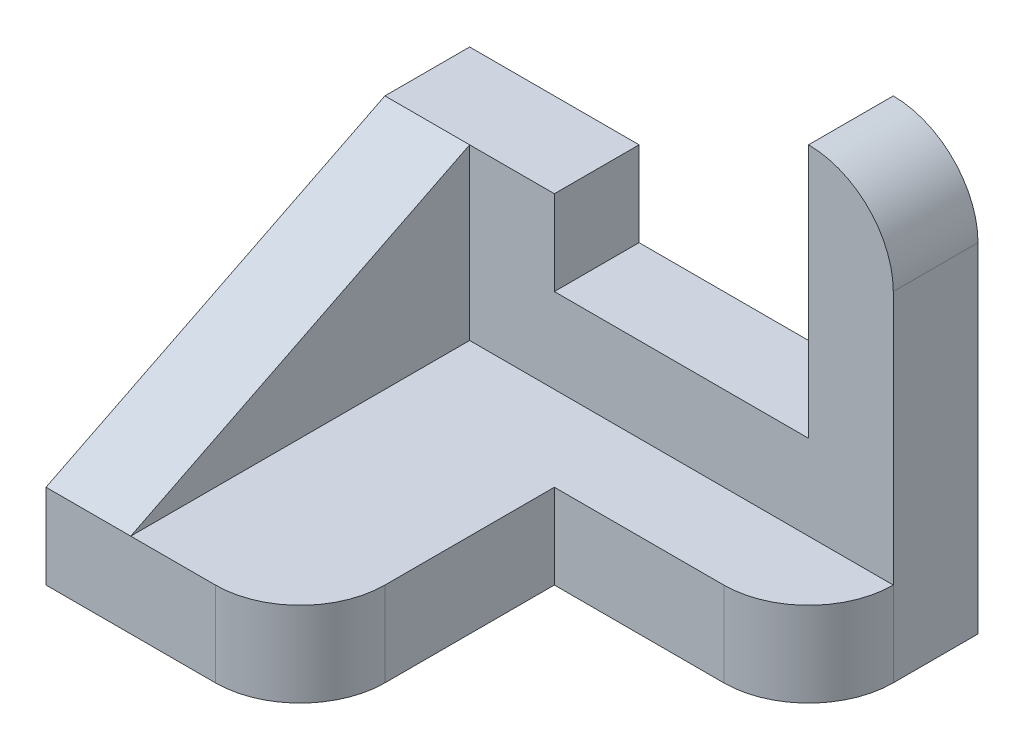
ISO-10303-21;
HEADER;
FILE_DESCRIPTION(('STEP AP214'),'2;1');
FILE_NAME('part.step','',(''),(''),'','','');
FILE_SCHEMA(('AUTOMOTIVE_DESIGN { 1 0 10303 214 1 1 1 1 }'));
ENDSEC;
DATA;
#1=APPLICATION_CONTEXT('core data for automotive mechanical design processes');
#2=APPLICATION_PROTOCOL_DEFINITION('international standard','automotive_design',2000,#1);
#3=PRODUCT_CONTEXT('',#1,'mechanical');
#4=PRODUCT('Part','Part','',(#3));
#5=PRODUCT_RELATED_PRODUCT_CATEGORY('part','',(#4));
#6=PRODUCT_DEFINITION_FORMATION('','',#4);
#7=PRODUCT_DEFINITION_CONTEXT('part definition',#1,'design');
#8=PRODUCT_DEFINITION('design','',#6,#7);
#9=PRODUCT_DEFINITION_SHAPE('','',#8);
#10=(LENGTH_UNIT() NAMED_UNIT(*) SI_UNIT(.MILLI.,.METRE.));
#11=(NAMED_UNIT(*) PLANE_ANGLE_UNIT() SI_UNIT($,.RADIAN.));
#12=(NAMED_UNIT(*) SI_UNIT($,.STERADIAN.) SOLID_ANGLE_UNIT());
#13=UNCERTAINTY_MEASURE_WITH_UNIT(LENGTH_MEASURE(1.E-05),#10,'distance_accuracy_value','');
#14=(GEOMETRIC_REPRESENTATION_CONTEXT(3) GLOBAL_UNCERTAINTY_ASSIGNED_CONTEXT((#13)) GLOBAL_UNIT_ASSIGNED_CONTEXT((#10,
#11,#12)) REPRESENTATION_CONTEXT('',''));
#15=CARTESIAN_POINT('',(0.,0.,0.));
#16=DIRECTION('',(0.,0.,1.));
#17=DIRECTION('',(1.,0.,0.));
#18=AXIS2_PLACEMENT_3D('',#15,#16,#17);
#19=CARTESIAN_POINT('',(0.,1.,0.));
#20=DIRECTION('',(0.,1.,0.));
#21=DIRECTION('',(0.,0.,1.));
#22=AXIS2_PLACEMENT_3D('',#19,#20,#21);
#23=PLANE('',#22);
#24=DIRECTION('',(0.,0.,-1.));
#25=VECTOR('',#24,1.);
#26=CARTESIAN_POINT('',(1.,1.,-4.));
#27=LINE('',#26,#25);
#28=CARTESIAN_POINT('',(1.,1.,0.));
#29=VERTEX_POINT('',#28);
#30=CARTESIAN_POINT('',(1.,1.,-4.));
#31=VERTEX_POINT('',#30);
#32=EDGE_CURVE('E139',#29,#31,#27,.T.);
#33=ORIENTED_EDGE('',*,*,#32,.F.);
#34=DIRECTION('',(-1.,0.,0.));
#35=VECTOR('',#34,1.);
#36=CARTESIAN_POINT('',(0.,1.,0.));
#37=LINE('',#36,#35);
#38=CARTESIAN_POINT('',(2.,1.,0.));
#39=VERTEX_POINT('',#38);
#40=EDGE_CURVE('E175',#39,#29,#37,.T.);
#41=ORIENTED_EDGE('',*,*,#40,.F.);
#42=CARTESIAN_POINT('',(2.,1.,-1.));
#43=DIRECTION('',(0.,1.,0.));
#44=DIRECTION('',(0.,0.,1.));
#45=AXIS2_PLACEMENT_3D('',#42,#43,#44);
#46=CIRCLE('',#45,1.);
#47=CARTESIAN_POINT('',(3.,1.,-1.));
#48=VERTEX_POINT('',#47);
#49=EDGE_CURVE('E177',#48,#39,#46,.F.);
#50=ORIENTED_EDGE('',*,*,#49,.F.);
#51=DIRECTION('',(0.,0.,1.));
#52=VECTOR('',#51,1.);
#53=CARTESIAN_POINT('',(3.,1.,0.));
#54=LINE('',#53,#52);
#55=CARTESIAN_POINT('',(3.,1.,-3.));
#56=VERTEX_POINT('',#55);
#57=EDGE_CURVE('E181',#56,#48,#54,.T.);
#58=ORIENTED_EDGE('',*,*,#57,.F.);
#59=DIRECTION('',(-1.,0.,0.));
#60=VECTOR('',#59,1.);
#61=CARTESIAN_POINT('',(0.,1.,-3.));
#62=LINE('',#61,#60);
#63=CARTESIAN_POINT('',(5.,1.,-3.));
#64=VERTEX_POINT('',#63);
#65=EDGE_CURVE('E184',#64,#56,#62,.T.);
#66=ORIENTED_EDGE('',*,*,#65,.F.);
#67=CARTESIAN_POINT('',(5.,1.,-4.));
#68=DIRECTION('',(0.,1.,0.));
#69=DIRECTION('',(0.,0.,1.));
#70=AXIS2_PLACEMENT_3D('',#67,#68,#69);
#71=CIRCLE('',#70,1.);
#72=CARTESIAN_POINT('',(6.,1.,-4.));
#73=VERTEX_POINT('',#72);
#74=EDGE_CURVE('E163',#73,#64,#71,.F.);
#75=ORIENTED_EDGE('',*,*,#74,.F.);
#76=DIRECTION('',(-1.,0.,0.));
#77=VECTOR('',#76,1.);
#78=CARTESIAN_POINT('',(0.,1.,-4.));
#79=LINE('',#78,#77);
#80=EDGE_CURVE('E154',#73,#31,#79,.T.);
#81=ORIENTED_EDGE('',*,*,#80,.T.);
#82=EDGE_LOOP('',(#33,#41,#50,#58,#66,#75,#81));
#83=FACE_BOUND('',#82,.T.);
#84=ADVANCED_FACE('F37',(#83),#23,.T.);
#85=CARTESIAN_POINT('',(6.00000000000001,1.,0.));
#86=DIRECTION('',(1.,0.,0.));
#87=DIRECTION('',(0.,0.,-1.));
#88=AXIS2_PLACEMENT_3D('',#85,#86,#87);
#89=PLANE('',#88);
#90=DIRECTION('',(0.,-1.,0.));
#91=VECTOR('',#90,1.);
#92=CARTESIAN_POINT('',(6.,1.,-5.));
#93=LINE('',#92,#91);
#94=CARTESIAN_POINT('',(6.,4.,-5.));
#95=VERTEX_POINT('',#94);
#96=CARTESIAN_POINT('',(6.,0.,-5.));
#97=VERTEX_POINT('',#96);
#98=EDGE_CURVE('E221',#95,#97,#93,.T.);
#99=ORIENTED_EDGE('',*,*,#98,.F.);
#100=DIRECTION('',(0.,0.,1.));
#101=VECTOR('',#100,1.);
#102=CARTESIAN_POINT('',(6.00000000000001,4.,0.));
#103=LINE('',#102,#101);
#104=CARTESIAN_POINT('',(6.,4.,-4.));
#105=VERTEX_POINT('',#104);
#106=EDGE_CURVE('E223',#95,#105,#103,.T.);
#107=ORIENTED_EDGE('',*,*,#106,.T.);
#108=DIRECTION('',(0.,-1.,0.));
#109=VECTOR('',#108,1.);
#110=CARTESIAN_POINT('',(6.,5.,-4.));
#111=LINE('',#110,#109);
#112=EDGE_CURVE('E229',#105,#73,#111,.T.);
#113=ORIENTED_EDGE('',*,*,#112,.T.);
#114=DIRECTION('',(0.,-1.,0.));
#115=VECTOR('',#114,1.);
#116=CARTESIAN_POINT('',(6.,1.,-4.));
#117=LINE('',#116,#115);
#118=CARTESIAN_POINT('',(6.,0.,-4.));
#119=VERTEX_POINT('',#118);
#120=EDGE_CURVE('E187',#73,#119,#117,.T.);
#121=ORIENTED_EDGE('',*,*,#120,.T.);
#122=DIRECTION('',(0.,0.,1.));
#123=VECTOR('',#122,1.);
#124=CARTESIAN_POINT('',(6.00000000000001,0.,0.));
#125=LINE('',#124,#123);
#126=EDGE_CURVE('E164',#97,#119,#125,.T.);
#127=ORIENTED_EDGE('',*,*,#126,.F.);
#128=EDGE_LOOP('',(#99,#107,#113,#121,#127));
#129=FACE_BOUND('',#128,.T.);
#130=ADVANCED_FACE('F305',(#129),#89,.T.);
#131=CARTESIAN_POINT('',(0.,1.,-5.));
#132=DIRECTION('',(0.,0.,-1.));
#133=DIRECTION('',(-1.,0.,0.));
#134=AXIS2_PLACEMENT_3D('',#131,#132,#133);
#135=PLANE('',#134);
#136=DIRECTION('',(0.,-1.,0.));
#137=VECTOR('',#136,1.);
#138=CARTESIAN_POINT('',(5.,5.,-5.));
#139=LINE('',#138,#137);
#140=CARTESIAN_POINT('',(5.,5.,-5.));
#141=VERTEX_POINT('',#140);
#142=CARTESIAN_POINT('',(5.,2.,-5.));
#143=VERTEX_POINT('',#142);
#144=EDGE_CURVE('E239',#141,#143,#139,.T.);
#145=ORIENTED_EDGE('',*,*,#144,.F.);
#146=CARTESIAN_POINT('',(5.,4.,-5.));
#147=DIRECTION('',(0.,0.,-1.));
#148=DIRECTION('',(-1.,0.,0.));
#149=AXIS2_PLACEMENT_3D('',#146,#147,#148);
#150=CIRCLE('',#149,1.);
#151=EDGE_CURVE('E11',#141,#95,#150,.T.);
#152=ORIENTED_EDGE('',*,*,#151,.T.);
#153=ORIENTED_EDGE('',*,*,#98,.T.);
#154=DIRECTION('',(1.,0.,0.));
#155=VECTOR('',#154,1.);
#156=CARTESIAN_POINT('',(0.,0.,-5.));
#157=LINE('',#156,#155);
#158=CARTESIAN_POINT('',(0.,0.,-5.));
#159=VERTEX_POINT('',#158);
#160=EDGE_CURVE('E168',#159,#97,#157,.T.);
#161=ORIENTED_EDGE('',*,*,#160,.F.);
#162=DIRECTION('',(0.,-1.,0.));
#163=VECTOR('',#162,1.);
#164=CARTESIAN_POINT('',(0.,1.,-5.));
#165=LINE('',#164,#163);
#166=CARTESIAN_POINT('',(0.,3.,-5.));
#167=VERTEX_POINT('',#166);
#168=EDGE_CURVE('E218',#167,#159,#165,.T.);
#169=ORIENTED_EDGE('',*,*,#168,.F.);
#170=DIRECTION('',(1.,0.,0.));
#171=VECTOR('',#170,1.);
#172=CARTESIAN_POINT('',(0.,3.,-5.));
#173=LINE('',#172,#171);
#174=CARTESIAN_POINT('',(2.,3.,-5.));
#175=VERTEX_POINT('',#174);
#176=EDGE_CURVE('E250',#167,#175,#173,.T.);
#177=ORIENTED_EDGE('',*,*,#176,.T.);
#178=DIRECTION('',(0.,-1.,0.));
#179=VECTOR('',#178,1.);
#180=CARTESIAN_POINT('',(2.,3.,-5.));
#181=LINE('',#180,#179);
#182=CARTESIAN_POINT('',(2.,2.,-5.));
#183=VERTEX_POINT('',#182);
#184=EDGE_CURVE('E260',#175,#183,#181,.T.);
#185=ORIENTED_EDGE('',*,*,#184,.T.);
#186=DIRECTION('',(1.,0.,0.));
#187=VECTOR('',#186,1.);
#188=CARTESIAN_POINT('',(0.,2.,-5.));
#189=LINE('',#188,#187);
#190=EDGE_CURVE('E171',#183,#143,#189,.T.);
#191=ORIENTED_EDGE('',*,*,#190,.T.);
#192=EDGE_LOOP('',(#145,#152,#153,#161,#169,#177,#185,#191));
#193=FACE_BOUND('',#192,.T.);
#194=ADVANCED_FACE('F268',(#193),#135,.T.);
#195=CARTESIAN_POINT('',(0.,1.,0.));
#196=DIRECTION('',(-1.,0.,0.));
#197=DIRECTION('',(0.,0.,1.));
#198=AXIS2_PLACEMENT_3D('',#195,#196,#197);
#199=PLANE('',#198);
#200=ORIENTED_EDGE('',*,*,#168,.T.);
#201=DIRECTION('',(0.,0.,-1.));
#202=VECTOR('',#201,1.);
#203=CARTESIAN_POINT('',(0.,0.,0.));
#204=LINE('',#203,#202);
#205=CARTESIAN_POINT('',(0.,0.,0.));
#206=VERTEX_POINT('',#205);
#207=EDGE_CURVE('E191',#206,#159,#204,.T.);
#208=ORIENTED_EDGE('',*,*,#207,.F.);
#209=DIRECTION('',(0.,-1.,0.));
#210=VECTOR('',#209,1.);
#211=CARTESIAN_POINT('',(0.,1.,0.));
#212=LINE('',#211,#210);
#213=CARTESIAN_POINT('',(0.,1.,0.));
#214=VERTEX_POINT('',#213);
#215=EDGE_CURVE('E216',#214,#206,#212,.T.);
#216=ORIENTED_EDGE('',*,*,#215,.F.);
#217=DIRECTION('',(0.,-0.447213595499957,0.894427190999916));
#218=VECTOR('',#217,1.);
#219=CARTESIAN_POINT('',(0.,1.,0.));
#220=LINE('',#219,#218);
#221=CARTESIAN_POINT('',(0.,3.,-4.));
#222=VERTEX_POINT('',#221);
#223=EDGE_CURVE('E148',#222,#214,#220,.T.);
#224=ORIENTED_EDGE('',*,*,#223,.F.);
#225=DIRECTION('',(0.,0.,-1.));
#226=VECTOR('',#225,1.);
#227=CARTESIAN_POINT('',(0.,3.,0.));
#228=LINE('',#227,#226);
#229=EDGE_CURVE('E253',#222,#167,#228,.T.);
#230=ORIENTED_EDGE('',*,*,#229,.T.);
#231=EDGE_LOOP('',(#200,#208,#216,#224,#230));
#232=FACE_BOUND('',#231,.T.);
#233=ADVANCED_FACE('F281',(#232),#199,.T.);
#234=CARTESIAN_POINT('',(0.,1.,0.));
#235=DIRECTION('',(0.,0.,1.));
#236=DIRECTION('',(1.,0.,0.));
#237=AXIS2_PLACEMENT_3D('',#234,#235,#236);
#238=PLANE('',#237);
#239=DIRECTION('',(-1.,0.,0.));
#240=VECTOR('',#239,1.);
#241=CARTESIAN_POINT('',(0.,0.,0.));
#242=LINE('',#241,#240);
#243=CARTESIAN_POINT('',(2.,0.,0.));
#244=VERTEX_POINT('',#243);
#245=EDGE_CURVE('E193',#244,#206,#242,.T.);
#246=ORIENTED_EDGE('',*,*,#245,.F.);
#247=DIRECTION('',(0.,-1.,0.));
#248=VECTOR('',#247,1.);
#249=CARTESIAN_POINT('',(2.,1.,0.));
#250=LINE('',#249,#248);
#251=EDGE_CURVE('E214',#39,#244,#250,.T.);
#252=ORIENTED_EDGE('',*,*,#251,.F.);
#253=ORIENTED_EDGE('',*,*,#40,.T.);
#254=DIRECTION('',(-1.,0.,0.));
#255=VECTOR('',#254,1.);
#256=CARTESIAN_POINT('',(1.,1.,0.));
#257=LINE('',#256,#255);
#258=EDGE_CURVE('E240',#29,#214,#257,.T.);
#259=ORIENTED_EDGE('',*,*,#258,.T.);
#260=ORIENTED_EDGE('',*,*,#215,.T.);
#261=EDGE_LOOP('',(#246,#252,#253,#259,#260));
#262=FACE_BOUND('',#261,.T.);
#263=ADVANCED_FACE('F287',(#262),#238,.T.);
#264=CARTESIAN_POINT('',(2.,1.,-1.));
#265=DIRECTION('',(0.,-1.,0.));
#266=DIRECTION('',(0.,0.,-1.));
#267=AXIS2_PLACEMENT_3D('',#264,#265,#266);
#268=CYLINDRICAL_SURFACE('',#267,1.);
#269=CARTESIAN_POINT('',(2.,0.,-1.));
#270=DIRECTION('',(0.,1.,0.));
#271=DIRECTION('',(0.,0.,1.));
#272=AXIS2_PLACEMENT_3D('',#269,#270,#271);
#273=CIRCLE('',#272,1.);
#274=CARTESIAN_POINT('',(3.,0.,-1.));
#275=VERTEX_POINT('',#274);
#276=EDGE_CURVE('E196',#275,#244,#273,.F.);
#277=ORIENTED_EDGE('',*,*,#276,.F.);
#278=DIRECTION('',(0.,-1.,0.));
#279=VECTOR('',#278,1.);
#280=CARTESIAN_POINT('',(3.,1.,-1.));
#281=LINE('',#280,#279);
#282=EDGE_CURVE('E212',#48,#275,#281,.T.);
#283=ORIENTED_EDGE('',*,*,#282,.F.);
#284=ORIENTED_EDGE('',*,*,#49,.T.);
#285=ORIENTED_EDGE('',*,*,#251,.T.);
#286=EDGE_LOOP('',(#277,#283,#284,#285));
#287=FACE_BOUND('',#286,.T.);
#288=ADVANCED_FACE('F292',(#287),#268,.T.);
#289=CARTESIAN_POINT('',(3.,1.,0.));
#290=DIRECTION('',(1.,0.,0.));
#291=DIRECTION('',(0.,0.,-1.));
#292=AXIS2_PLACEMENT_3D('',#289,#290,#291);
#293=PLANE('',#292);
#294=DIRECTION('',(0.,0.,1.));
#295=VECTOR('',#294,1.);
#296=CARTESIAN_POINT('',(3.,0.,0.));
#297=LINE('',#296,#295);
#298=CARTESIAN_POINT('',(3.,0.,-3.));
#299=VERTEX_POINT('',#298);
#300=EDGE_CURVE('E199',#299,#275,#297,.T.);
#301=ORIENTED_EDGE('',*,*,#300,.F.);
#302=DIRECTION('',(0.,-1.,0.));
#303=VECTOR('',#302,1.);
#304=CARTESIAN_POINT('',(3.,1.,-3.));
#305=LINE('',#304,#303);
#306=EDGE_CURVE('E210',#56,#299,#305,.T.);
#307=ORIENTED_EDGE('',*,*,#306,.F.);
#308=ORIENTED_EDGE('',*,*,#57,.T.);
#309=ORIENTED_EDGE('',*,*,#282,.T.);
#310=EDGE_LOOP('',(#301,#307,#308,#309));
#311=FACE_BOUND('',#310,.T.);
#312=ADVANCED_FACE('F295',(#311),#293,.T.);
#313=CARTESIAN_POINT('',(0.,1.,-3.));
#314=DIRECTION('',(0.,0.,1.));
#315=DIRECTION('',(1.,0.,0.));
#316=AXIS2_PLACEMENT_3D('',#313,#314,#315);
#317=PLANE('',#316);
#318=DIRECTION('',(-1.,0.,0.));
#319=VECTOR('',#318,1.);
#320=CARTESIAN_POINT('',(0.,0.,-3.));
#321=LINE('',#320,#319);
#322=CARTESIAN_POINT('',(5.,0.,-3.));
#323=VERTEX_POINT('',#322);
#324=EDGE_CURVE('E202',#323,#299,#321,.T.);
#325=ORIENTED_EDGE('',*,*,#324,.F.);
#326=DIRECTION('',(0.,-1.,0.));
#327=VECTOR('',#326,1.);
#328=CARTESIAN_POINT('',(5.,1.,-3.));
#329=LINE('',#328,#327);
#330=EDGE_CURVE('E208',#64,#323,#329,.T.);
#331=ORIENTED_EDGE('',*,*,#330,.F.);
#332=ORIENTED_EDGE('',*,*,#65,.T.);
#333=ORIENTED_EDGE('',*,*,#306,.T.);
#334=EDGE_LOOP('',(#325,#331,#332,#333));
#335=FACE_BOUND('',#334,.T.);
#336=ADVANCED_FACE('F298',(#335),#317,.T.);
#337=CARTESIAN_POINT('',(5.,1.,-4.));
#338=DIRECTION('',(0.,-1.,0.));
#339=DIRECTION('',(0.,0.,-1.));
#340=AXIS2_PLACEMENT_3D('',#337,#338,#339);
#341=CYLINDRICAL_SURFACE('',#340,1.);
#342=CARTESIAN_POINT('',(5.,0.,-4.));
#343=DIRECTION('',(0.,1.,0.));
#344=DIRECTION('',(0.,0.,1.));
#345=AXIS2_PLACEMENT_3D('',#342,#343,#344);
#346=CIRCLE('',#345,1.);
#347=EDGE_CURVE('E178',#119,#323,#346,.F.);
#348=ORIENTED_EDGE('',*,*,#347,.F.);
#349=ORIENTED_EDGE('',*,*,#120,.F.);
#350=ORIENTED_EDGE('',*,*,#74,.T.);
#351=ORIENTED_EDGE('',*,*,#330,.T.);
#352=EDGE_LOOP('',(#348,#349,#350,#351));
#353=FACE_BOUND('',#352,.T.);
#354=ADVANCED_FACE('F301',(#353),#341,.T.);
#355=CARTESIAN_POINT('',(0.,0.,0.));
#356=DIRECTION('',(0.,1.,0.));
#357=DIRECTION('',(0.,0.,1.));
#358=AXIS2_PLACEMENT_3D('',#355,#356,#357);
#359=PLANE('',#358);
#360=ORIENTED_EDGE('',*,*,#160,.T.);
#361=ORIENTED_EDGE('',*,*,#126,.T.);
#362=ORIENTED_EDGE('',*,*,#347,.T.);
#363=ORIENTED_EDGE('',*,*,#324,.T.);
#364=ORIENTED_EDGE('',*,*,#300,.T.);
#365=ORIENTED_EDGE('',*,*,#276,.T.);
#366=ORIENTED_EDGE('',*,*,#245,.T.);
#367=ORIENTED_EDGE('',*,*,#207,.T.);
#368=EDGE_LOOP('',(#360,#361,#362,#363,#364,#365,#366,#367));
#369=FACE_BOUND('',#368,.T.);
#370=ADVANCED_FACE('F307',(#369),#359,.F.);
#371=CARTESIAN_POINT('',(0.,2.,-4.));
#372=DIRECTION('',(0.,0.,-1.));
#373=DIRECTION('',(-1.,0.,0.));
#374=AXIS2_PLACEMENT_3D('',#371,#372,#373);
#375=PLANE('',#374);
#376=DIRECTION('',(1.,0.,0.));
#377=VECTOR('',#376,1.);
#378=CARTESIAN_POINT('',(0.,3.,-4.));
#379=LINE('',#378,#377);
#380=CARTESIAN_POINT('',(1.,3.,-4.));
#381=VERTEX_POINT('',#380);
#382=CARTESIAN_POINT('',(2.,3.,-4.));
#383=VERTEX_POINT('',#382);
#384=EDGE_CURVE('E157',#381,#383,#379,.T.);
#385=ORIENTED_EDGE('',*,*,#384,.F.);
#386=DIRECTION('',(0.,1.,0.));
#387=VECTOR('',#386,1.);
#388=CARTESIAN_POINT('',(1.,3.,-4.));
#389=LINE('',#388,#387);
#390=EDGE_CURVE('E142',#31,#381,#389,.T.);
#391=ORIENTED_EDGE('',*,*,#390,.F.);
#392=ORIENTED_EDGE('',*,*,#80,.F.);
#393=ORIENTED_EDGE('',*,*,#112,.F.);
#394=CARTESIAN_POINT('',(5.,4.,-4.));
#395=DIRECTION('',(0.,0.,-1.));
#396=DIRECTION('',(-1.,0.,0.));
#397=AXIS2_PLACEMENT_3D('',#394,#395,#396);
#398=CIRCLE('',#397,1.);
#399=CARTESIAN_POINT('',(5.,5.,-4.));
#400=VERTEX_POINT('',#399);
#401=EDGE_CURVE('E45',#105,#400,#398,.F.);
#402=ORIENTED_EDGE('',*,*,#401,.T.);
#403=DIRECTION('',(0.,-1.,0.));
#404=VECTOR('',#403,1.);
#405=CARTESIAN_POINT('',(5.,5.,-4.));
#406=LINE('',#405,#404);
#407=CARTESIAN_POINT('',(5.,2.,-4.));
#408=VERTEX_POINT('',#407);
#409=EDGE_CURVE('E227',#400,#408,#406,.T.);
#410=ORIENTED_EDGE('',*,*,#409,.T.);
#411=DIRECTION('',(1.,0.,0.));
#412=VECTOR('',#411,1.);
#413=CARTESIAN_POINT('',(0.,2.,-4.));
#414=LINE('',#413,#412);
#415=CARTESIAN_POINT('',(2.,2.,-4.));
#416=VERTEX_POINT('',#415);
#417=EDGE_CURVE('E263',#416,#408,#414,.T.);
#418=ORIENTED_EDGE('',*,*,#417,.F.);
#419=DIRECTION('',(0.,-1.,0.));
#420=VECTOR('',#419,1.);
#421=CARTESIAN_POINT('',(2.,3.,-4.));
#422=LINE('',#421,#420);
#423=EDGE_CURVE('E258',#383,#416,#422,.T.);
#424=ORIENTED_EDGE('',*,*,#423,.F.);
#425=EDGE_LOOP('',(#385,#391,#392,#393,#402,#410,#418,#424));
#426=FACE_BOUND('',#425,.T.);
#427=ADVANCED_FACE('F152',(#426),#375,.F.);
#428=CARTESIAN_POINT('',(0.,2.,0.));
#429=DIRECTION('',(0.,1.,0.));
#430=DIRECTION('',(0.,0.,1.));
#431=AXIS2_PLACEMENT_3D('',#428,#429,#430);
#432=PLANE('',#431);
#433=ORIENTED_EDGE('',*,*,#417,.T.);
#434=DIRECTION('',(0.,0.,-1.));
#435=VECTOR('',#434,1.);
#436=CARTESIAN_POINT('',(5.,2.,0.));
#437=LINE('',#436,#435);
#438=EDGE_CURVE('E236',#408,#143,#437,.T.);
#439=ORIENTED_EDGE('',*,*,#438,.T.);
#440=ORIENTED_EDGE('',*,*,#190,.F.);
#441=DIRECTION('',(0.,0.,1.));
#442=VECTOR('',#441,1.);
#443=CARTESIAN_POINT('',(2.,2.,0.));
#444=LINE('',#443,#442);
#445=EDGE_CURVE('E165',#183,#416,#444,.T.);
#446=ORIENTED_EDGE('',*,*,#445,.T.);
#447=EDGE_LOOP('',(#433,#439,#440,#446));
#448=FACE_BOUND('',#447,.T.);
#449=ADVANCED_FACE('F270',(#448),#432,.T.);
#450=CARTESIAN_POINT('',(2.,3.,0.));
#451=DIRECTION('',(1.,0.,0.));
#452=DIRECTION('',(0.,0.,-1.));
#453=AXIS2_PLACEMENT_3D('',#450,#451,#452);
#454=PLANE('',#453);
#455=ORIENTED_EDGE('',*,*,#423,.T.);
#456=ORIENTED_EDGE('',*,*,#445,.F.);
#457=ORIENTED_EDGE('',*,*,#184,.F.);
#458=DIRECTION('',(0.,0.,1.));
#459=VECTOR('',#458,1.);
#460=CARTESIAN_POINT('',(2.,3.,0.));
#461=LINE('',#460,#459);
#462=EDGE_CURVE('E237',#175,#383,#461,.T.);
#463=ORIENTED_EDGE('',*,*,#462,.T.);
#464=EDGE_LOOP('',(#455,#456,#457,#463));
#465=FACE_BOUND('',#464,.T.);
#466=ADVANCED_FACE('F273',(#465),#454,.T.);
#467=CARTESIAN_POINT('',(0.,3.,0.));
#468=DIRECTION('',(0.,1.,0.));
#469=DIRECTION('',(0.,0.,1.));
#470=AXIS2_PLACEMENT_3D('',#467,#468,#469);
#471=PLANE('',#470);
#472=ORIENTED_EDGE('',*,*,#462,.F.);
#473=ORIENTED_EDGE('',*,*,#176,.F.);
#474=ORIENTED_EDGE('',*,*,#229,.F.);
#475=EDGE_CURVE('E256',#222,#381,#379,.T.);
#476=ORIENTED_EDGE('',*,*,#475,.T.);
#477=ORIENTED_EDGE('',*,*,#384,.T.);
#478=EDGE_LOOP('',(#472,#473,#474,#476,#477));
#479=FACE_BOUND('',#478,.T.);
#480=ADVANCED_FACE('F276',(#479),#471,.T.);
#481=CARTESIAN_POINT('',(5.,5.,0.));
#482=DIRECTION('',(-1.,0.,0.));
#483=DIRECTION('',(0.,0.,1.));
#484=AXIS2_PLACEMENT_3D('',#481,#482,#483);
#485=PLANE('',#484);
#486=ORIENTED_EDGE('',*,*,#144,.T.);
#487=ORIENTED_EDGE('',*,*,#438,.F.);
#488=ORIENTED_EDGE('',*,*,#409,.F.);
#489=DIRECTION('',(0.,0.,-1.));
#490=VECTOR('',#489,1.);
#491=CARTESIAN_POINT('',(5.,5.,0.));
#492=LINE('',#491,#490);
#493=EDGE_CURVE('E233',#400,#141,#492,.T.);
#494=ORIENTED_EDGE('',*,*,#493,.T.);
#495=EDGE_LOOP('',(#486,#487,#488,#494));
#496=FACE_BOUND('',#495,.T.);
#497=ADVANCED_FACE('F232',(#496),#485,.T.);
#498=CARTESIAN_POINT('',(5.00000000000001,4.,0.));
#499=DIRECTION('',(0.,0.,1.));
#500=DIRECTION('',(1.,0.,0.));
#501=AXIS2_PLACEMENT_3D('',#498,#499,#500);
#502=CYLINDRICAL_SURFACE('',#501,1.);
#503=ORIENTED_EDGE('',*,*,#151,.F.);
#504=ORIENTED_EDGE('',*,*,#493,.F.);
#505=ORIENTED_EDGE('',*,*,#401,.F.);
#506=ORIENTED_EDGE('',*,*,#106,.F.);
#507=EDGE_LOOP('',(#503,#504,#505,#506));
#508=FACE_BOUND('',#507,.T.);
#509=ADVANCED_FACE('F39',(#508),#502,.T.);
#510=CARTESIAN_POINT('',(1.,1.,0.));
#511=DIRECTION('',(0.,-0.894427190999916,-0.447213595499957));
#512=DIRECTION('',(0.,0.447213595499957,-0.894427190999916));
#513=AXIS2_PLACEMENT_3D('',#510,#511,#512);
#514=PLANE('',#513);
#515=ORIENTED_EDGE('',*,*,#223,.T.);
#516=ORIENTED_EDGE('',*,*,#258,.F.);
#517=DIRECTION('',(0.,-0.447213595499957,0.894427190999916));
#518=VECTOR('',#517,1.);
#519=CARTESIAN_POINT('',(1.,1.,0.));
#520=LINE('',#519,#518);
#521=EDGE_CURVE('E52',#381,#29,#520,.T.);
#522=ORIENTED_EDGE('',*,*,#521,.F.);
#523=ORIENTED_EDGE('',*,*,#475,.F.);
#524=EDGE_LOOP('',(#515,#516,#522,#523));
#525=FACE_BOUND('',#524,.T.);
#526=ADVANCED_FACE('F284',(#525),#514,.F.);
#527=CARTESIAN_POINT('',(1.,0.,0.));
#528=DIRECTION('',(1.,0.,0.));
#529=DIRECTION('',(0.,0.,-1.));
#530=AXIS2_PLACEMENT_3D('',#527,#528,#529);
#531=PLANE('',#530);
#532=ORIENTED_EDGE('',*,*,#32,.T.);
#533=ORIENTED_EDGE('',*,*,#390,.T.);
#534=ORIENTED_EDGE('',*,*,#521,.T.);
#535=EDGE_LOOP('',(#532,#533,#534));
#536=FACE_BOUND('',#535,.T.);
#537=ADVANCED_FACE('F141',(#536),#531,.T.);
#538=CLOSED_SHELL('',(#84,#130,#194,#233,#263,#288,#312,#336,#354,#370,#427,#449,#466,#480,#497,
#509,#526,#537));
#539=MANIFOLD_SOLID_BREP('B2',#538);
#540=ADVANCED_BREP_SHAPE_REPRESENTATION('',(#18,#539),#14);
#541=SHAPE_DEFINITION_REPRESENTATION(#9,#540);
ENDSEC;
END-ISO-10303-21;
